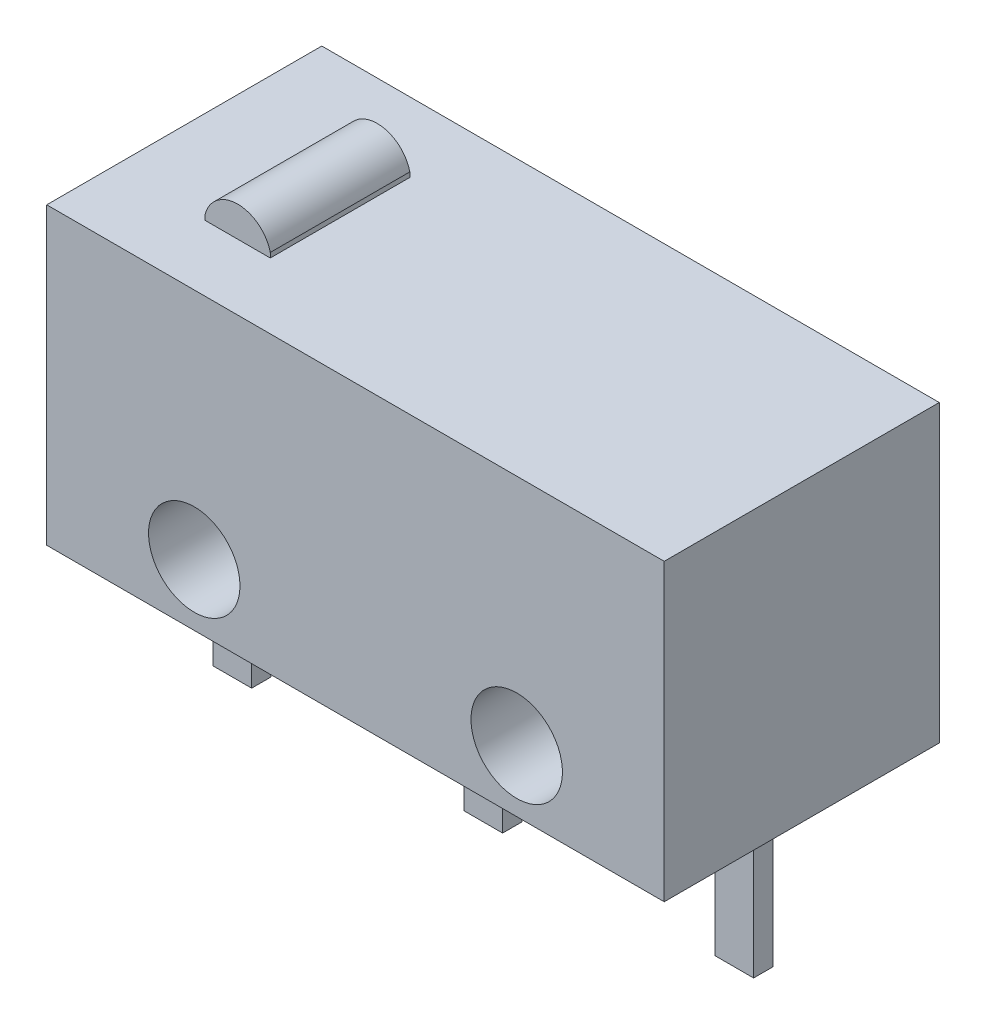
ISO-10303-21;
HEADER;
FILE_DESCRIPTION(('STEP AP214'),'2;1');
FILE_NAME('part.step','',(''),(''),'','','');
FILE_SCHEMA(('AUTOMOTIVE_DESIGN { 1 0 10303 214 1 1 1 1 }'));
ENDSEC;
DATA;
#1=APPLICATION_CONTEXT('core data for automotive mechanical design processes');
#2=APPLICATION_PROTOCOL_DEFINITION('international standard','automotive_design',2000,#1);
#3=PRODUCT_CONTEXT('',#1,'mechanical');
#4=PRODUCT('Part','Part','',(#3));
#5=PRODUCT_RELATED_PRODUCT_CATEGORY('part','',(#4));
#6=PRODUCT_DEFINITION_FORMATION('','',#4);
#7=PRODUCT_DEFINITION_CONTEXT('part definition',#1,'design');
#8=PRODUCT_DEFINITION('design','',#6,#7);
#9=PRODUCT_DEFINITION_SHAPE('','',#8);
#10=(LENGTH_UNIT() NAMED_UNIT(*) SI_UNIT(.MILLI.,.METRE.));
#11=(NAMED_UNIT(*) PLANE_ANGLE_UNIT() SI_UNIT($,.RADIAN.));
#12=(NAMED_UNIT(*) SI_UNIT($,.STERADIAN.) SOLID_ANGLE_UNIT());
#13=UNCERTAINTY_MEASURE_WITH_UNIT(LENGTH_MEASURE(1.E-05),#10,'distance_accuracy_value','');
#14=(GEOMETRIC_REPRESENTATION_CONTEXT(3) GLOBAL_UNCERTAINTY_ASSIGNED_CONTEXT((#13)) GLOBAL_UNIT_ASSIGNED_CONTEXT((#10,
#11,#12)) REPRESENTATION_CONTEXT('',''));
#15=CARTESIAN_POINT('',(0.,0.,0.));
#16=DIRECTION('',(0.,0.,1.));
#17=DIRECTION('',(1.,0.,0.));
#18=AXIS2_PLACEMENT_3D('',#15,#16,#17);
#19=CARTESIAN_POINT('',(-9.68,-1.5,2.815));
#20=DIRECTION('',(0.,-1.,0.));
#21=DIRECTION('',(0.,0.,-1.));
#22=AXIS2_PLACEMENT_3D('',#19,#20,#21);
#23=PLANE('',#22);
#24=DIRECTION('',(0.,0.,-1.));
#25=VECTOR('',#24,1.);
#26=CARTESIAN_POINT('',(-3.665,-1.5,-0.2425));
#27=LINE('',#26,#25);
#28=CARTESIAN_POINT('',(-3.665,-1.5,0.157500000000001));
#29=VERTEX_POINT('',#28);
#30=CARTESIAN_POINT('',(-3.665,-1.5,-0.2425));
#31=VERTEX_POINT('',#30);
#32=EDGE_CURVE('E250',#29,#31,#27,.T.);
#33=ORIENTED_EDGE('',*,*,#32,.F.);
#34=DIRECTION('',(-1.,0.,0.));
#35=VECTOR('',#34,1.);
#36=CARTESIAN_POINT('',(-3.665,-1.5,0.157500000000001));
#37=LINE('',#36,#35);
#38=CARTESIAN_POINT('',(-2.865,-1.5,0.157500000000001));
#39=VERTEX_POINT('',#38);
#40=EDGE_CURVE('E236',#39,#29,#37,.T.);
#41=ORIENTED_EDGE('',*,*,#40,.F.);
#42=DIRECTION('',(0.,0.,1.));
#43=VECTOR('',#42,1.);
#44=CARTESIAN_POINT('',(-2.865,-1.5,0.157500000000001));
#45=LINE('',#44,#43);
#46=CARTESIAN_POINT('',(-2.865,-1.5,-0.2425));
#47=VERTEX_POINT('',#46);
#48=EDGE_CURVE('E241',#47,#39,#45,.T.);
#49=ORIENTED_EDGE('',*,*,#48,.F.);
#50=DIRECTION('',(1.,0.,0.));
#51=VECTOR('',#50,1.);
#52=CARTESIAN_POINT('',(-2.865,-1.5,-0.2425));
#53=LINE('',#52,#51);
#54=EDGE_CURVE('E252',#31,#47,#53,.T.);
#55=ORIENTED_EDGE('',*,*,#54,.F.);
#56=EDGE_LOOP('',(#33,#41,#49,#55));
#57=FACE_BOUND('',#56,.T.);
#58=DIRECTION('',(0.,0.,-1.));
#59=VECTOR('',#58,1.);
#60=CARTESIAN_POINT('',(3.15,-1.5,2.815));
#61=LINE('',#60,#59);
#62=CARTESIAN_POINT('',(3.15,-1.5,2.815));
#63=VERTEX_POINT('',#62);
#64=CARTESIAN_POINT('',(3.15,-1.5,-2.9));
#65=VERTEX_POINT('',#64);
#66=EDGE_CURVE('E315',#63,#65,#61,.T.);
#67=ORIENTED_EDGE('',*,*,#66,.F.);
#68=DIRECTION('',(1.,0.,0.));
#69=VECTOR('',#68,1.);
#70=CARTESIAN_POINT('',(-9.68,-1.5,2.815));
#71=LINE('',#70,#69);
#72=CARTESIAN_POINT('',(-9.68,-1.5,2.815));
#73=VERTEX_POINT('',#72);
#74=EDGE_CURVE('E11',#73,#63,#71,.T.);
#75=ORIENTED_EDGE('',*,*,#74,.F.);
#76=DIRECTION('',(0.,0.,-1.));
#77=VECTOR('',#76,1.);
#78=CARTESIAN_POINT('',(-9.68,-1.5,2.815));
#79=LINE('',#78,#77);
#80=CARTESIAN_POINT('',(-9.68,-1.5,-2.9));
#81=VERTEX_POINT('',#80);
#82=EDGE_CURVE('E301',#73,#81,#79,.T.);
#83=ORIENTED_EDGE('',*,*,#82,.T.);
#84=DIRECTION('',(1.,0.,0.));
#85=VECTOR('',#84,1.);
#86=CARTESIAN_POINT('',(-9.68,-1.5,-2.9));
#87=LINE('',#86,#85);
#88=EDGE_CURVE('E314',#81,#65,#87,.T.);
#89=ORIENTED_EDGE('',*,*,#88,.T.);
#90=EDGE_LOOP('',(#67,#75,#83,#89));
#91=FACE_BOUND('',#90,.T.);
#92=DIRECTION('',(0.,0.,-1.));
#93=VECTOR('',#92,1.);
#94=CARTESIAN_POINT('',(-8.88,-1.5,-0.2425));
#95=LINE('',#94,#93);
#96=CARTESIAN_POINT('',(-8.88,-1.5,0.1575));
#97=VERTEX_POINT('',#96);
#98=CARTESIAN_POINT('',(-8.88,-1.5,-0.2425));
#99=VERTEX_POINT('',#98);
#100=EDGE_CURVE('E279',#97,#99,#95,.T.);
#101=ORIENTED_EDGE('',*,*,#100,.F.);
#102=DIRECTION('',(-1.,0.,0.));
#103=VECTOR('',#102,1.);
#104=CARTESIAN_POINT('',(-8.88,-1.5,0.1575));
#105=LINE('',#104,#103);
#106=CARTESIAN_POINT('',(-8.08,-1.5,0.1575));
#107=VERTEX_POINT('',#106);
#108=EDGE_CURVE('E265',#107,#97,#105,.T.);
#109=ORIENTED_EDGE('',*,*,#108,.F.);
#110=DIRECTION('',(0.,0.,1.));
#111=VECTOR('',#110,1.);
#112=CARTESIAN_POINT('',(-8.08,-1.5,0.1575));
#113=LINE('',#112,#111);
#114=CARTESIAN_POINT('',(-8.08,-1.5,-0.2425));
#115=VERTEX_POINT('',#114);
#116=EDGE_CURVE('E270',#115,#107,#113,.T.);
#117=ORIENTED_EDGE('',*,*,#116,.F.);
#118=DIRECTION('',(1.,0.,0.));
#119=VECTOR('',#118,1.);
#120=CARTESIAN_POINT('',(-8.08,-1.5,-0.2425));
#121=LINE('',#120,#119);
#122=EDGE_CURVE('E281',#99,#115,#121,.T.);
#123=ORIENTED_EDGE('',*,*,#122,.F.);
#124=EDGE_LOOP('',(#101,#109,#117,#123));
#125=FACE_BOUND('',#124,.T.);
#126=DIRECTION('',(-1.,0.,0.));
#127=VECTOR('',#126,1.);
#128=CARTESIAN_POINT('',(2.35,-1.5,0.1575));
#129=LINE('',#128,#127);
#130=CARTESIAN_POINT('',(2.35,-1.5,0.1575));
#131=VERTEX_POINT('',#130);
#132=CARTESIAN_POINT('',(1.55,-1.5,0.1575));
#133=VERTEX_POINT('',#132);
#134=EDGE_CURVE('E223',#131,#133,#129,.T.);
#135=ORIENTED_EDGE('',*,*,#134,.F.);
#136=DIRECTION('',(0.,0.,1.));
#137=VECTOR('',#136,1.);
#138=CARTESIAN_POINT('',(2.35,-1.5,-0.2425));
#139=LINE('',#138,#137);
#140=CARTESIAN_POINT('',(2.35,-1.5,-0.2425));
#141=VERTEX_POINT('',#140);
#142=EDGE_CURVE('E206',#141,#131,#139,.T.);
#143=ORIENTED_EDGE('',*,*,#142,.F.);
#144=DIRECTION('',(1.,0.,0.));
#145=VECTOR('',#144,1.);
#146=CARTESIAN_POINT('',(1.55,-1.5,-0.2425));
#147=LINE('',#146,#145);
#148=CARTESIAN_POINT('',(1.55,-1.5,-0.2425));
#149=VERTEX_POINT('',#148);
#150=EDGE_CURVE('E214',#149,#141,#147,.T.);
#151=ORIENTED_EDGE('',*,*,#150,.F.);
#152=DIRECTION('',(0.,0.,-1.));
#153=VECTOR('',#152,1.);
#154=CARTESIAN_POINT('',(1.55,-1.5,0.1575));
#155=LINE('',#154,#153);
#156=EDGE_CURVE('E225',#133,#149,#155,.T.);
#157=ORIENTED_EDGE('',*,*,#156,.F.);
#158=EDGE_LOOP('',(#135,#143,#151,#157));
#159=FACE_BOUND('',#158,.T.);
#160=ADVANCED_FACE('F32',(#57,#91,#125,#159),#23,.T.);
#161=CARTESIAN_POINT('',(-9.68,4.627,2.815));
#162=DIRECTION('',(0.,0.,1.));
#163=DIRECTION('',(1.,0.,0.));
#164=AXIS2_PLACEMENT_3D('',#161,#162,#163);
#165=PLANE('',#164);
#166=CARTESIAN_POINT('',(0.085,-0.222999999999999,2.815));
#167=DIRECTION('',(0.,0.,1.));
#168=DIRECTION('',(-1.,0.,0.));
#169=AXIS2_PLACEMENT_3D('',#166,#167,#168);
#170=CIRCLE('',#169,0.95);
#171=CARTESIAN_POINT('',(-0.865,-0.222999999999999,2.815));
#172=VERTEX_POINT('',#171);
#173=EDGE_CURVE('E294',#172,#172,#170,.T.);
#174=ORIENTED_EDGE('',*,*,#173,.F.);
#175=EDGE_LOOP('',(#174));
#176=FACE_BOUND('',#175,.T.);
#177=CARTESIAN_POINT('',(-6.615,-0.222999999999999,2.815));
#178=DIRECTION('',(0.,0.,1.));
#179=DIRECTION('',(1.,0.,0.));
#180=AXIS2_PLACEMENT_3D('',#177,#178,#179);
#181=CIRCLE('',#180,0.95);
#182=CARTESIAN_POINT('',(-5.665,-0.222999999999999,2.815));
#183=VERTEX_POINT('',#182);
#184=EDGE_CURVE('E297',#183,#183,#181,.T.);
#185=ORIENTED_EDGE('',*,*,#184,.F.);
#186=EDGE_LOOP('',(#185));
#187=FACE_BOUND('',#186,.T.);
#188=DIRECTION('',(0.,-1.,0.));
#189=VECTOR('',#188,1.);
#190=CARTESIAN_POINT('',(3.15,4.627,2.815));
#191=LINE('',#190,#189);
#192=CARTESIAN_POINT('',(3.15,4.627,2.815));
#193=VERTEX_POINT('',#192);
#194=EDGE_CURVE('E305',#193,#63,#191,.T.);
#195=ORIENTED_EDGE('',*,*,#194,.F.);
#196=DIRECTION('',(1.,0.,0.));
#197=VECTOR('',#196,1.);
#198=CARTESIAN_POINT('',(-9.68,4.627,2.815));
#199=LINE('',#198,#197);
#200=CARTESIAN_POINT('',(-9.68,4.627,2.815));
#201=VERTEX_POINT('',#200);
#202=EDGE_CURVE('E40',#201,#193,#199,.T.);
#203=ORIENTED_EDGE('',*,*,#202,.F.);
#204=DIRECTION('',(0.,-1.,0.));
#205=VECTOR('',#204,1.);
#206=CARTESIAN_POINT('',(-9.68,4.627,2.815));
#207=LINE('',#206,#205);
#208=EDGE_CURVE('E311',#201,#73,#207,.T.);
#209=ORIENTED_EDGE('',*,*,#208,.T.);
#210=ORIENTED_EDGE('',*,*,#74,.T.);
#211=EDGE_LOOP('',(#195,#203,#209,#210));
#212=FACE_BOUND('',#211,.T.);
#213=ADVANCED_FACE('F355',(#176,#187,#212),#165,.T.);
#214=CARTESIAN_POINT('',(-9.68,4.627,-2.9));
#215=DIRECTION('',(0.,1.,0.));
#216=DIRECTION('',(0.,0.,1.));
#217=AXIS2_PLACEMENT_3D('',#214,#215,#216);
#218=PLANE('',#217);
#219=DIRECTION('',(-1.,0.,0.));
#220=VECTOR('',#219,1.);
#221=CARTESIAN_POINT('',(-7.75567903627533,4.627,1.45));
#222=LINE('',#221,#220);
#223=CARTESIAN_POINT('',(-6.40017995171817,4.627,1.45));
#224=VERTEX_POINT('',#223);
#225=CARTESIAN_POINT('',(-7.75567903627533,4.627,1.45));
#226=VERTEX_POINT('',#225);
#227=EDGE_CURVE('E181',#224,#226,#222,.T.);
#228=ORIENTED_EDGE('',*,*,#227,.T.);
#229=DIRECTION('',(0.,0.,-1.));
#230=VECTOR('',#229,1.);
#231=CARTESIAN_POINT('',(-7.75567903627533,4.627,1.45));
#232=LINE('',#231,#230);
#233=CARTESIAN_POINT('',(-7.75567903627533,4.627,-1.45));
#234=VERTEX_POINT('',#233);
#235=EDGE_CURVE('E194',#226,#234,#232,.T.);
#236=ORIENTED_EDGE('',*,*,#235,.T.);
#237=DIRECTION('',(-1.,0.,0.));
#238=VECTOR('',#237,1.);
#239=CARTESIAN_POINT('',(-7.75567903627533,4.627,-1.45));
#240=LINE('',#239,#238);
#241=CARTESIAN_POINT('',(-6.40017995171817,4.627,-1.45));
#242=VERTEX_POINT('',#241);
#243=EDGE_CURVE('E195',#242,#234,#240,.T.);
#244=ORIENTED_EDGE('',*,*,#243,.F.);
#245=DIRECTION('',(0.,0.,-1.));
#246=VECTOR('',#245,1.);
#247=CARTESIAN_POINT('',(-6.40017995171817,4.627,1.45));
#248=LINE('',#247,#246);
#249=EDGE_CURVE('E207',#224,#242,#248,.T.);
#250=ORIENTED_EDGE('',*,*,#249,.F.);
#251=EDGE_LOOP('',(#228,#236,#244,#250));
#252=FACE_BOUND('',#251,.T.);
#253=DIRECTION('',(0.,0.,1.));
#254=VECTOR('',#253,1.);
#255=CARTESIAN_POINT('',(3.15,4.627,-2.9));
#256=LINE('',#255,#254);
#257=CARTESIAN_POINT('',(3.15,4.627,-2.9));
#258=VERTEX_POINT('',#257);
#259=EDGE_CURVE('E321',#258,#193,#256,.T.);
#260=ORIENTED_EDGE('',*,*,#259,.F.);
#261=DIRECTION('',(1.,0.,0.));
#262=VECTOR('',#261,1.);
#263=CARTESIAN_POINT('',(-9.68,4.627,-2.9));
#264=LINE('',#263,#262);
#265=CARTESIAN_POINT('',(-9.68,4.627,-2.9));
#266=VERTEX_POINT('',#265);
#267=EDGE_CURVE('E327',#266,#258,#264,.T.);
#268=ORIENTED_EDGE('',*,*,#267,.F.);
#269=DIRECTION('',(0.,0.,1.));
#270=VECTOR('',#269,1.);
#271=CARTESIAN_POINT('',(-9.68,4.627,-2.9));
#272=LINE('',#271,#270);
#273=EDGE_CURVE('E308',#266,#201,#272,.T.);
#274=ORIENTED_EDGE('',*,*,#273,.T.);
#275=ORIENTED_EDGE('',*,*,#202,.T.);
#276=EDGE_LOOP('',(#260,#268,#274,#275));
#277=FACE_BOUND('',#276,.T.);
#278=ADVANCED_FACE('F339',(#252,#277),#218,.T.);
#279=CARTESIAN_POINT('',(-9.68,-1.5,-2.9));
#280=DIRECTION('',(0.,0.,-1.));
#281=DIRECTION('',(-1.,0.,0.));
#282=AXIS2_PLACEMENT_3D('',#279,#280,#281);
#283=PLANE('',#282);
#284=CARTESIAN_POINT('',(0.085,-0.222999999999999,-2.9));
#285=DIRECTION('',(0.,0.,-1.));
#286=DIRECTION('',(-1.,0.,0.));
#287=AXIS2_PLACEMENT_3D('',#284,#285,#286);
#288=CIRCLE('',#287,0.95);
#289=CARTESIAN_POINT('',(-0.865,-0.222999999999999,-2.9));
#290=VERTEX_POINT('',#289);
#291=EDGE_CURVE('E35',#290,#290,#288,.T.);
#292=ORIENTED_EDGE('',*,*,#291,.F.);
#293=EDGE_LOOP('',(#292));
#294=FACE_BOUND('',#293,.T.);
#295=CARTESIAN_POINT('',(-6.615,-0.222999999999999,-2.9));
#296=DIRECTION('',(0.,0.,-1.));
#297=DIRECTION('',(-1.,0.,0.));
#298=AXIS2_PLACEMENT_3D('',#295,#296,#297);
#299=CIRCLE('',#298,0.95);
#300=CARTESIAN_POINT('',(-7.565,-0.222999999999999,-2.9));
#301=VERTEX_POINT('',#300);
#302=EDGE_CURVE('E300',#301,#301,#299,.T.);
#303=ORIENTED_EDGE('',*,*,#302,.F.);
#304=EDGE_LOOP('',(#303));
#305=FACE_BOUND('',#304,.T.);
#306=DIRECTION('',(0.,1.,0.));
#307=VECTOR('',#306,1.);
#308=CARTESIAN_POINT('',(3.15,-1.5,-2.9));
#309=LINE('',#308,#307);
#310=EDGE_CURVE('E318',#65,#258,#309,.T.);
#311=ORIENTED_EDGE('',*,*,#310,.F.);
#312=ORIENTED_EDGE('',*,*,#88,.F.);
#313=DIRECTION('',(0.,1.,0.));
#314=VECTOR('',#313,1.);
#315=CARTESIAN_POINT('',(-9.68,-1.5,-2.9));
#316=LINE('',#315,#314);
#317=EDGE_CURVE('E304',#81,#266,#316,.T.);
#318=ORIENTED_EDGE('',*,*,#317,.T.);
#319=ORIENTED_EDGE('',*,*,#267,.T.);
#320=EDGE_LOOP('',(#311,#312,#318,#319));
#321=FACE_BOUND('',#320,.T.);
#322=ADVANCED_FACE('F335',(#294,#305,#321),#283,.T.);
#323=CARTESIAN_POINT('',(-9.68,-1.5,-2.9));
#324=DIRECTION('',(1.,0.,0.));
#325=DIRECTION('',(0.,0.,-1.));
#326=AXIS2_PLACEMENT_3D('',#323,#324,#325);
#327=PLANE('',#326);
#328=ORIENTED_EDGE('',*,*,#82,.F.);
#329=ORIENTED_EDGE('',*,*,#208,.F.);
#330=ORIENTED_EDGE('',*,*,#273,.F.);
#331=ORIENTED_EDGE('',*,*,#317,.F.);
#332=EDGE_LOOP('',(#328,#329,#330,#331));
#333=FACE_BOUND('',#332,.T.);
#334=ADVANCED_FACE('F338',(#333),#327,.F.);
#335=CARTESIAN_POINT('',(3.15,-1.5,-2.9));
#336=DIRECTION('',(1.,0.,0.));
#337=DIRECTION('',(0.,0.,-1.));
#338=AXIS2_PLACEMENT_3D('',#335,#336,#337);
#339=PLANE('',#338);
#340=ORIENTED_EDGE('',*,*,#66,.T.);
#341=ORIENTED_EDGE('',*,*,#310,.T.);
#342=ORIENTED_EDGE('',*,*,#259,.T.);
#343=ORIENTED_EDGE('',*,*,#194,.T.);
#344=EDGE_LOOP('',(#340,#341,#342,#343));
#345=FACE_BOUND('',#344,.T.);
#346=ADVANCED_FACE('F346',(#345),#339,.T.);
#347=CARTESIAN_POINT('',(-6.615,-0.222999999999999,-17.985));
#348=DIRECTION('',(0.,0.,1.));
#349=DIRECTION('',(1.,0.,0.));
#350=AXIS2_PLACEMENT_3D('',#347,#348,#349);
#351=CYLINDRICAL_SURFACE('',#350,0.95);
#352=ORIENTED_EDGE('',*,*,#302,.T.);
#353=EDGE_LOOP('',(#352));
#354=FACE_BOUND('',#353,.T.);
#355=ORIENTED_EDGE('',*,*,#184,.T.);
#356=EDGE_LOOP('',(#355));
#357=FACE_BOUND('',#356,.T.);
#358=ADVANCED_FACE('F332',(#354,#357),#351,.F.);
#359=CARTESIAN_POINT('',(0.085,-0.222999999999999,-17.985));
#360=DIRECTION('',(0.,0.,1.));
#361=DIRECTION('',(1.,0.,0.));
#362=AXIS2_PLACEMENT_3D('',#359,#360,#361);
#363=CYLINDRICAL_SURFACE('',#362,0.95);
#364=ORIENTED_EDGE('',*,*,#291,.T.);
#365=EDGE_LOOP('',(#364));
#366=FACE_BOUND('',#365,.T.);
#367=ORIENTED_EDGE('',*,*,#173,.T.);
#368=EDGE_LOOP('',(#367));
#369=FACE_BOUND('',#368,.T.);
#370=ADVANCED_FACE('F424',(#366,#369),#363,.F.);
#371=CARTESIAN_POINT('',(-8.88,-4.6,0.1575));
#372=DIRECTION('',(0.,0.,-1.));
#373=DIRECTION('',(-1.,0.,0.));
#374=AXIS2_PLACEMENT_3D('',#371,#372,#373);
#375=PLANE('',#374);
#376=ORIENTED_EDGE('',*,*,#108,.T.);
#377=DIRECTION('',(0.,1.,0.));
#378=VECTOR('',#377,1.);
#379=CARTESIAN_POINT('',(-8.88,-4.6,0.1575));
#380=LINE('',#379,#378);
#381=CARTESIAN_POINT('',(-8.88,-4.6,0.1575));
#382=VERTEX_POINT('',#381);
#383=EDGE_CURVE('E292',#382,#97,#380,.T.);
#384=ORIENTED_EDGE('',*,*,#383,.F.);
#385=DIRECTION('',(-1.,0.,0.));
#386=VECTOR('',#385,1.);
#387=CARTESIAN_POINT('',(-8.88,-4.6,0.1575));
#388=LINE('',#387,#386);
#389=CARTESIAN_POINT('',(-8.08,-4.6,0.1575));
#390=VERTEX_POINT('',#389);
#391=EDGE_CURVE('E266',#390,#382,#388,.T.);
#392=ORIENTED_EDGE('',*,*,#391,.F.);
#393=DIRECTION('',(0.,1.,0.));
#394=VECTOR('',#393,1.);
#395=CARTESIAN_POINT('',(-8.08,-4.6,0.1575));
#396=LINE('',#395,#394);
#397=EDGE_CURVE('E276',#390,#107,#396,.T.);
#398=ORIENTED_EDGE('',*,*,#397,.T.);
#399=EDGE_LOOP('',(#376,#384,#392,#398));
#400=FACE_BOUND('',#399,.T.);
#401=ADVANCED_FACE('F420',(#400),#375,.F.);
#402=CARTESIAN_POINT('',(-8.88,-4.6,-0.2425));
#403=DIRECTION('',(1.,0.,0.));
#404=DIRECTION('',(0.,0.,-1.));
#405=AXIS2_PLACEMENT_3D('',#402,#403,#404);
#406=PLANE('',#405);
#407=ORIENTED_EDGE('',*,*,#100,.T.);
#408=DIRECTION('',(0.,1.,0.));
#409=VECTOR('',#408,1.);
#410=CARTESIAN_POINT('',(-8.88,-4.6,-0.2425));
#411=LINE('',#410,#409);
#412=CARTESIAN_POINT('',(-8.88,-4.6,-0.2425));
#413=VERTEX_POINT('',#412);
#414=EDGE_CURVE('E289',#413,#99,#411,.T.);
#415=ORIENTED_EDGE('',*,*,#414,.F.);
#416=DIRECTION('',(0.,0.,-1.));
#417=VECTOR('',#416,1.);
#418=CARTESIAN_POINT('',(-8.88,-4.6,-0.2425));
#419=LINE('',#418,#417);
#420=EDGE_CURVE('E269',#382,#413,#419,.T.);
#421=ORIENTED_EDGE('',*,*,#420,.F.);
#422=ORIENTED_EDGE('',*,*,#383,.T.);
#423=EDGE_LOOP('',(#407,#415,#421,#422));
#424=FACE_BOUND('',#423,.T.);
#425=ADVANCED_FACE('F416',(#424),#406,.F.);
#426=CARTESIAN_POINT('',(-8.08,-4.6,-0.2425));
#427=DIRECTION('',(0.,0.,1.));
#428=DIRECTION('',(1.,0.,0.));
#429=AXIS2_PLACEMENT_3D('',#426,#427,#428);
#430=PLANE('',#429);
#431=ORIENTED_EDGE('',*,*,#122,.T.);
#432=DIRECTION('',(0.,1.,0.));
#433=VECTOR('',#432,1.);
#434=CARTESIAN_POINT('',(-8.08,-4.6,-0.2425));
#435=LINE('',#434,#433);
#436=CARTESIAN_POINT('',(-8.08,-4.6,-0.2425));
#437=VERTEX_POINT('',#436);
#438=EDGE_CURVE('E287',#437,#115,#435,.T.);
#439=ORIENTED_EDGE('',*,*,#438,.F.);
#440=DIRECTION('',(1.,0.,0.));
#441=VECTOR('',#440,1.);
#442=CARTESIAN_POINT('',(-8.08,-4.6,-0.2425));
#443=LINE('',#442,#441);
#444=EDGE_CURVE('E272',#413,#437,#443,.T.);
#445=ORIENTED_EDGE('',*,*,#444,.F.);
#446=ORIENTED_EDGE('',*,*,#414,.T.);
#447=EDGE_LOOP('',(#431,#439,#445,#446));
#448=FACE_BOUND('',#447,.T.);
#449=ADVANCED_FACE('F412',(#448),#430,.F.);
#450=CARTESIAN_POINT('',(-8.08,-4.6,0.1575));
#451=DIRECTION('',(-1.,0.,0.));
#452=DIRECTION('',(0.,0.,1.));
#453=AXIS2_PLACEMENT_3D('',#450,#451,#452);
#454=PLANE('',#453);
#455=ORIENTED_EDGE('',*,*,#116,.T.);
#456=ORIENTED_EDGE('',*,*,#397,.F.);
#457=DIRECTION('',(0.,0.,1.));
#458=VECTOR('',#457,1.);
#459=CARTESIAN_POINT('',(-8.08,-4.6,0.1575));
#460=LINE('',#459,#458);
#461=EDGE_CURVE('E274',#437,#390,#460,.T.);
#462=ORIENTED_EDGE('',*,*,#461,.F.);
#463=ORIENTED_EDGE('',*,*,#438,.T.);
#464=EDGE_LOOP('',(#455,#456,#462,#463));
#465=FACE_BOUND('',#464,.T.);
#466=ADVANCED_FACE('F408',(#465),#454,.F.);
#467=CARTESIAN_POINT('',(-8.08,-4.6,0.1575));
#468=DIRECTION('',(0.,1.,0.));
#469=DIRECTION('',(0.,0.,1.));
#470=AXIS2_PLACEMENT_3D('',#467,#468,#469);
#471=PLANE('',#470);
#472=ORIENTED_EDGE('',*,*,#391,.T.);
#473=ORIENTED_EDGE('',*,*,#420,.T.);
#474=ORIENTED_EDGE('',*,*,#444,.T.);
#475=ORIENTED_EDGE('',*,*,#461,.T.);
#476=EDGE_LOOP('',(#472,#473,#474,#475));
#477=FACE_BOUND('',#476,.T.);
#478=ADVANCED_FACE('F405',(#477),#471,.F.);
#479=CARTESIAN_POINT('',(-3.665,-4.6,0.157500000000001));
#480=DIRECTION('',(0.,0.,-1.));
#481=DIRECTION('',(-1.,0.,0.));
#482=AXIS2_PLACEMENT_3D('',#479,#480,#481);
#483=PLANE('',#482);
#484=ORIENTED_EDGE('',*,*,#40,.T.);
#485=DIRECTION('',(0.,1.,0.));
#486=VECTOR('',#485,1.);
#487=CARTESIAN_POINT('',(-3.665,-4.6,0.157500000000001));
#488=LINE('',#487,#486);
#489=CARTESIAN_POINT('',(-3.665,-4.6,0.157500000000001));
#490=VERTEX_POINT('',#489);
#491=EDGE_CURVE('E263',#490,#29,#488,.T.);
#492=ORIENTED_EDGE('',*,*,#491,.F.);
#493=DIRECTION('',(-1.,0.,0.));
#494=VECTOR('',#493,1.);
#495=CARTESIAN_POINT('',(-3.665,-4.6,0.157500000000001));
#496=LINE('',#495,#494);
#497=CARTESIAN_POINT('',(-2.865,-4.6,0.157500000000001));
#498=VERTEX_POINT('',#497);
#499=EDGE_CURVE('E237',#498,#490,#496,.T.);
#500=ORIENTED_EDGE('',*,*,#499,.F.);
#501=DIRECTION('',(0.,1.,0.));
#502=VECTOR('',#501,1.);
#503=CARTESIAN_POINT('',(-2.865,-4.6,0.157500000000001));
#504=LINE('',#503,#502);
#505=EDGE_CURVE('E247',#498,#39,#504,.T.);
#506=ORIENTED_EDGE('',*,*,#505,.T.);
#507=EDGE_LOOP('',(#484,#492,#500,#506));
#508=FACE_BOUND('',#507,.T.);
#509=ADVANCED_FACE('F387',(#508),#483,.F.);
#510=CARTESIAN_POINT('',(-3.665,-4.6,-0.2425));
#511=DIRECTION('',(1.,0.,0.));
#512=DIRECTION('',(0.,0.,-1.));
#513=AXIS2_PLACEMENT_3D('',#510,#511,#512);
#514=PLANE('',#513);
#515=ORIENTED_EDGE('',*,*,#32,.T.);
#516=DIRECTION('',(0.,1.,0.));
#517=VECTOR('',#516,1.);
#518=CARTESIAN_POINT('',(-3.665,-4.6,-0.2425));
#519=LINE('',#518,#517);
#520=CARTESIAN_POINT('',(-3.665,-4.6,-0.2425));
#521=VERTEX_POINT('',#520);
#522=EDGE_CURVE('E260',#521,#31,#519,.T.);
#523=ORIENTED_EDGE('',*,*,#522,.F.);
#524=DIRECTION('',(0.,0.,-1.));
#525=VECTOR('',#524,1.);
#526=CARTESIAN_POINT('',(-3.665,-4.6,-0.2425));
#527=LINE('',#526,#525);
#528=EDGE_CURVE('E240',#490,#521,#527,.T.);
#529=ORIENTED_EDGE('',*,*,#528,.F.);
#530=ORIENTED_EDGE('',*,*,#491,.T.);
#531=EDGE_LOOP('',(#515,#523,#529,#530));
#532=FACE_BOUND('',#531,.T.);
#533=ADVANCED_FACE('F375',(#532),#514,.F.);
#534=CARTESIAN_POINT('',(-2.865,-4.6,-0.2425));
#535=DIRECTION('',(0.,0.,1.));
#536=DIRECTION('',(1.,0.,0.));
#537=AXIS2_PLACEMENT_3D('',#534,#535,#536);
#538=PLANE('',#537);
#539=ORIENTED_EDGE('',*,*,#54,.T.);
#540=DIRECTION('',(0.,1.,0.));
#541=VECTOR('',#540,1.);
#542=CARTESIAN_POINT('',(-2.865,-4.6,-0.2425));
#543=LINE('',#542,#541);
#544=CARTESIAN_POINT('',(-2.865,-4.6,-0.2425));
#545=VERTEX_POINT('',#544);
#546=EDGE_CURVE('E258',#545,#47,#543,.T.);
#547=ORIENTED_EDGE('',*,*,#546,.F.);
#548=DIRECTION('',(1.,0.,0.));
#549=VECTOR('',#548,1.);
#550=CARTESIAN_POINT('',(-2.865,-4.6,-0.2425));
#551=LINE('',#550,#549);
#552=EDGE_CURVE('E243',#521,#545,#551,.T.);
#553=ORIENTED_EDGE('',*,*,#552,.F.);
#554=ORIENTED_EDGE('',*,*,#522,.T.);
#555=EDGE_LOOP('',(#539,#547,#553,#554));
#556=FACE_BOUND('',#555,.T.);
#557=ADVANCED_FACE('F379',(#556),#538,.F.);
#558=CARTESIAN_POINT('',(-2.865,-4.6,0.157500000000001));
#559=DIRECTION('',(-1.,0.,0.));
#560=DIRECTION('',(0.,0.,1.));
#561=AXIS2_PLACEMENT_3D('',#558,#559,#560);
#562=PLANE('',#561);
#563=ORIENTED_EDGE('',*,*,#48,.T.);
#564=ORIENTED_EDGE('',*,*,#505,.F.);
#565=DIRECTION('',(0.,0.,1.));
#566=VECTOR('',#565,1.);
#567=CARTESIAN_POINT('',(-2.865,-4.6,0.157500000000001));
#568=LINE('',#567,#566);
#569=EDGE_CURVE('E245',#545,#498,#568,.T.);
#570=ORIENTED_EDGE('',*,*,#569,.F.);
#571=ORIENTED_EDGE('',*,*,#546,.T.);
#572=EDGE_LOOP('',(#563,#564,#570,#571));
#573=FACE_BOUND('',#572,.T.);
#574=ADVANCED_FACE('F389',(#573),#562,.F.);
#575=CARTESIAN_POINT('',(-2.865,-4.6,0.157500000000001));
#576=DIRECTION('',(0.,1.,0.));
#577=DIRECTION('',(0.,0.,1.));
#578=AXIS2_PLACEMENT_3D('',#575,#576,#577);
#579=PLANE('',#578);
#580=ORIENTED_EDGE('',*,*,#499,.T.);
#581=ORIENTED_EDGE('',*,*,#528,.T.);
#582=ORIENTED_EDGE('',*,*,#552,.T.);
#583=ORIENTED_EDGE('',*,*,#569,.T.);
#584=EDGE_LOOP('',(#580,#581,#582,#583));
#585=FACE_BOUND('',#584,.T.);
#586=ADVANCED_FACE('F383',(#585),#579,.F.);
#587=CARTESIAN_POINT('',(2.35,-4.6,-0.2425));
#588=DIRECTION('',(-1.,0.,0.));
#589=DIRECTION('',(0.,0.,1.));
#590=AXIS2_PLACEMENT_3D('',#587,#588,#589);
#591=PLANE('',#590);
#592=ORIENTED_EDGE('',*,*,#142,.T.);
#593=DIRECTION('',(0.,1.,0.));
#594=VECTOR('',#593,1.);
#595=CARTESIAN_POINT('',(2.35,-4.6,0.1575));
#596=LINE('',#595,#594);
#597=CARTESIAN_POINT('',(2.35,-4.6,0.1575));
#598=VERTEX_POINT('',#597);
#599=EDGE_CURVE('E234',#598,#131,#596,.T.);
#600=ORIENTED_EDGE('',*,*,#599,.F.);
#601=DIRECTION('',(0.,0.,1.));
#602=VECTOR('',#601,1.);
#603=CARTESIAN_POINT('',(2.35,-4.6,-0.2425));
#604=LINE('',#603,#602);
#605=CARTESIAN_POINT('',(2.35,-4.6,-0.2425));
#606=VERTEX_POINT('',#605);
#607=EDGE_CURVE('E210',#606,#598,#604,.T.);
#608=ORIENTED_EDGE('',*,*,#607,.F.);
#609=DIRECTION('',(0.,1.,0.));
#610=VECTOR('',#609,1.);
#611=CARTESIAN_POINT('',(2.35,-4.6,-0.2425));
#612=LINE('',#611,#610);
#613=EDGE_CURVE('E220',#606,#141,#612,.T.);
#614=ORIENTED_EDGE('',*,*,#613,.T.);
#615=EDGE_LOOP('',(#592,#600,#608,#614));
#616=FACE_BOUND('',#615,.T.);
#617=ADVANCED_FACE('F396',(#616),#591,.F.);
#618=CARTESIAN_POINT('',(2.35,-4.6,0.1575));
#619=DIRECTION('',(0.,0.,-1.));
#620=DIRECTION('',(-1.,0.,0.));
#621=AXIS2_PLACEMENT_3D('',#618,#619,#620);
#622=PLANE('',#621);
#623=ORIENTED_EDGE('',*,*,#134,.T.);
#624=DIRECTION('',(0.,1.,0.));
#625=VECTOR('',#624,1.);
#626=CARTESIAN_POINT('',(1.55,-4.6,0.1575));
#627=LINE('',#626,#625);
#628=CARTESIAN_POINT('',(1.55,-4.6,0.1575));
#629=VERTEX_POINT('',#628);
#630=EDGE_CURVE('E231',#629,#133,#627,.T.);
#631=ORIENTED_EDGE('',*,*,#630,.F.);
#632=DIRECTION('',(-1.,0.,0.));
#633=VECTOR('',#632,1.);
#634=CARTESIAN_POINT('',(2.35,-4.6,0.1575));
#635=LINE('',#634,#633);
#636=EDGE_CURVE('E213',#598,#629,#635,.T.);
#637=ORIENTED_EDGE('',*,*,#636,.F.);
#638=ORIENTED_EDGE('',*,*,#599,.T.);
#639=EDGE_LOOP('',(#623,#631,#637,#638));
#640=FACE_BOUND('',#639,.T.);
#641=ADVANCED_FACE('F499',(#640),#622,.F.);
#642=CARTESIAN_POINT('',(1.55,-4.6,0.1575));
#643=DIRECTION('',(1.,0.,0.));
#644=DIRECTION('',(0.,0.,-1.));
#645=AXIS2_PLACEMENT_3D('',#642,#643,#644);
#646=PLANE('',#645);
#647=ORIENTED_EDGE('',*,*,#156,.T.);
#648=DIRECTION('',(0.,1.,0.));
#649=VECTOR('',#648,1.);
#650=CARTESIAN_POINT('',(1.55,-4.6,-0.2425));
#651=LINE('',#650,#649);
#652=CARTESIAN_POINT('',(1.55,-4.6,-0.2425));
#653=VERTEX_POINT('',#652);
#654=EDGE_CURVE('E56',#653,#149,#651,.T.);
#655=ORIENTED_EDGE('',*,*,#654,.F.);
#656=DIRECTION('',(0.,0.,-1.));
#657=VECTOR('',#656,1.);
#658=CARTESIAN_POINT('',(1.55,-4.6,0.1575));
#659=LINE('',#658,#657);
#660=EDGE_CURVE('E216',#629,#653,#659,.T.);
#661=ORIENTED_EDGE('',*,*,#660,.F.);
#662=ORIENTED_EDGE('',*,*,#630,.T.);
#663=EDGE_LOOP('',(#647,#655,#661,#662));
#664=FACE_BOUND('',#663,.T.);
#665=ADVANCED_FACE('F508',(#664),#646,.F.);
#666=CARTESIAN_POINT('',(1.55,-4.6,-0.2425));
#667=DIRECTION('',(0.,0.,1.));
#668=DIRECTION('',(1.,0.,0.));
#669=AXIS2_PLACEMENT_3D('',#666,#667,#668);
#670=PLANE('',#669);
#671=ORIENTED_EDGE('',*,*,#150,.T.);
#672=ORIENTED_EDGE('',*,*,#613,.F.);
#673=DIRECTION('',(1.,0.,0.));
#674=VECTOR('',#673,1.);
#675=CARTESIAN_POINT('',(1.55,-4.6,-0.2425));
#676=LINE('',#675,#674);
#677=EDGE_CURVE('E218',#653,#606,#676,.T.);
#678=ORIENTED_EDGE('',*,*,#677,.F.);
#679=ORIENTED_EDGE('',*,*,#654,.T.);
#680=EDGE_LOOP('',(#671,#672,#678,#679));
#681=FACE_BOUND('',#680,.T.);
#682=ADVANCED_FACE('F518',(#681),#670,.F.);
#683=CARTESIAN_POINT('',(2.35,-4.6,0.1575));
#684=DIRECTION('',(0.,-1.,0.));
#685=DIRECTION('',(0.,0.,-1.));
#686=AXIS2_PLACEMENT_3D('',#683,#684,#685);
#687=PLANE('',#686);
#688=ORIENTED_EDGE('',*,*,#607,.T.);
#689=ORIENTED_EDGE('',*,*,#636,.T.);
#690=ORIENTED_EDGE('',*,*,#660,.T.);
#691=ORIENTED_EDGE('',*,*,#677,.T.);
#692=EDGE_LOOP('',(#688,#689,#690,#691));
#693=FACE_BOUND('',#692,.T.);
#694=ADVANCED_FACE('F528',(#693),#687,.T.);
#695=CARTESIAN_POINT('',(-7.75567903627533,4.627,1.45));
#696=DIRECTION('',(-1.,0.,0.));
#697=DIRECTION('',(0.,0.,1.));
#698=AXIS2_PLACEMENT_3D('',#695,#696,#697);
#699=PLANE('',#698);
#700=DIRECTION('',(0.,1.,0.));
#701=VECTOR('',#700,1.);
#702=CARTESIAN_POINT('',(-7.75567903627533,4.627,-1.45));
#703=LINE('',#702,#701);
#704=CARTESIAN_POINT('',(-7.75567903627533,4.727,-1.45));
#705=VERTEX_POINT('',#704);
#706=EDGE_CURVE('E201',#234,#705,#703,.T.);
#707=ORIENTED_EDGE('',*,*,#706,.F.);
#708=ORIENTED_EDGE('',*,*,#235,.F.);
#709=DIRECTION('',(0.,1.,0.));
#710=VECTOR('',#709,1.);
#711=CARTESIAN_POINT('',(-7.75567903627533,4.627,1.45));
#712=LINE('',#711,#710);
#713=CARTESIAN_POINT('',(-7.75567903627533,4.727,1.45));
#714=VERTEX_POINT('',#713);
#715=EDGE_CURVE('E188',#226,#714,#712,.T.);
#716=ORIENTED_EDGE('',*,*,#715,.T.);
#717=DIRECTION('',(0.,0.,-1.));
#718=VECTOR('',#717,1.);
#719=CARTESIAN_POINT('',(-7.75567903627533,4.727,1.45));
#720=LINE('',#719,#718);
#721=EDGE_CURVE('E172',#714,#705,#720,.T.);
#722=ORIENTED_EDGE('',*,*,#721,.T.);
#723=EDGE_LOOP('',(#707,#708,#716,#722));
#724=FACE_BOUND('',#723,.T.);
#725=ADVANCED_FACE('F192',(#724),#699,.T.);
#726=CARTESIAN_POINT('',(-6.40017995171817,4.627,1.45));
#727=DIRECTION('',(1.,0.,0.));
#728=DIRECTION('',(0.,0.,-1.));
#729=AXIS2_PLACEMENT_3D('',#726,#727,#728);
#730=PLANE('',#729);
#731=DIRECTION('',(0.,-1.,0.));
#732=VECTOR('',#731,1.);
#733=CARTESIAN_POINT('',(-6.40017995171817,4.627,-1.45));
#734=LINE('',#733,#732);
#735=CARTESIAN_POINT('',(-6.40017995171817,4.727,-1.45));
#736=VERTEX_POINT('',#735);
#737=EDGE_CURVE('E48',#736,#242,#734,.T.);
#738=ORIENTED_EDGE('',*,*,#737,.F.);
#739=DIRECTION('',(0.,0.,-1.));
#740=VECTOR('',#739,1.);
#741=CARTESIAN_POINT('',(-6.40017995171817,4.727,1.45));
#742=LINE('',#741,#740);
#743=CARTESIAN_POINT('',(-6.40017995171817,4.727,1.45));
#744=VERTEX_POINT('',#743);
#745=EDGE_CURVE('E180',#744,#736,#742,.T.);
#746=ORIENTED_EDGE('',*,*,#745,.F.);
#747=DIRECTION('',(0.,-1.,0.));
#748=VECTOR('',#747,1.);
#749=CARTESIAN_POINT('',(-6.40017995171817,4.627,1.45));
#750=LINE('',#749,#748);
#751=EDGE_CURVE('E190',#744,#224,#750,.T.);
#752=ORIENTED_EDGE('',*,*,#751,.T.);
#753=ORIENTED_EDGE('',*,*,#249,.T.);
#754=EDGE_LOOP('',(#738,#746,#752,#753));
#755=FACE_BOUND('',#754,.T.);
#756=ADVANCED_FACE('F552',(#755),#730,.T.);
#757=CARTESIAN_POINT('',(-7.07792949399675,4.56154784202727,1.45));
#758=DIRECTION('',(0.,0.,-1.));
#759=DIRECTION('',(-1.,0.,0.));
#760=AXIS2_PLACEMENT_3D('',#757,#758,#759);
#761=CYLINDRICAL_SURFACE('',#760,0.697652390977522);
#762=CARTESIAN_POINT('',(-7.07792949399675,4.56154784202727,-1.45));
#763=DIRECTION('',(0.,0.,-1.));
#764=DIRECTION('',(1.,0.,0.));
#765=AXIS2_PLACEMENT_3D('',#762,#763,#764);
#766=CIRCLE('',#765,0.697652390977522);
#767=EDGE_CURVE('E176',#705,#736,#766,.T.);
#768=ORIENTED_EDGE('',*,*,#767,.F.);
#769=ORIENTED_EDGE('',*,*,#721,.F.);
#770=CARTESIAN_POINT('',(-7.07792949399675,4.56154784202727,1.45));
#771=DIRECTION('',(0.,0.,-1.));
#772=DIRECTION('',(1.,0.,0.));
#773=AXIS2_PLACEMENT_3D('',#770,#771,#772);
#774=CIRCLE('',#773,0.697652390977522);
#775=EDGE_CURVE('E175',#714,#744,#774,.T.);
#776=ORIENTED_EDGE('',*,*,#775,.T.);
#777=ORIENTED_EDGE('',*,*,#745,.T.);
#778=EDGE_LOOP('',(#768,#769,#776,#777));
#779=FACE_BOUND('',#778,.T.);
#780=ADVANCED_FACE('F174',(#779),#761,.T.);
#781=CARTESIAN_POINT('',(-7.07792949399675,4.56154784202727,1.45));
#782=DIRECTION('',(0.,0.,1.));
#783=DIRECTION('',(1.,0.,0.));
#784=AXIS2_PLACEMENT_3D('',#781,#782,#783);
#785=PLANE('',#784);
#786=ORIENTED_EDGE('',*,*,#715,.F.);
#787=ORIENTED_EDGE('',*,*,#227,.F.);
#788=ORIENTED_EDGE('',*,*,#751,.F.);
#789=ORIENTED_EDGE('',*,*,#775,.F.);
#790=EDGE_LOOP('',(#786,#787,#788,#789));
#791=FACE_BOUND('',#790,.T.);
#792=ADVANCED_FACE('F186',(#791),#785,.T.);
#793=CARTESIAN_POINT('',(-7.07792949399675,4.56154784202727,-1.45));
#794=DIRECTION('',(0.,0.,1.));
#795=DIRECTION('',(1.,0.,0.));
#796=AXIS2_PLACEMENT_3D('',#793,#794,#795);
#797=PLANE('',#796);
#798=ORIENTED_EDGE('',*,*,#706,.T.);
#799=ORIENTED_EDGE('',*,*,#767,.T.);
#800=ORIENTED_EDGE('',*,*,#737,.T.);
#801=ORIENTED_EDGE('',*,*,#243,.T.);
#802=EDGE_LOOP('',(#798,#799,#800,#801));
#803=FACE_BOUND('',#802,.T.);
#804=ADVANCED_FACE('F578',(#803),#797,.F.);
#805=CLOSED_SHELL('',(#160,#213,#278,#322,#334,#346,#358,#370,#401,#425,#449,#466,#478,#509,
#533,#557,#574,#586,#617,#641,#665,#682,#694,#725,#756,#780,#792,#804));
#806=MANIFOLD_SOLID_BREP('B2',#805);
#807=ADVANCED_BREP_SHAPE_REPRESENTATION('',(#18,#806),#14);
#808=SHAPE_DEFINITION_REPRESENTATION(#9,#807);
ENDSEC;
END-ISO-10303-21;
